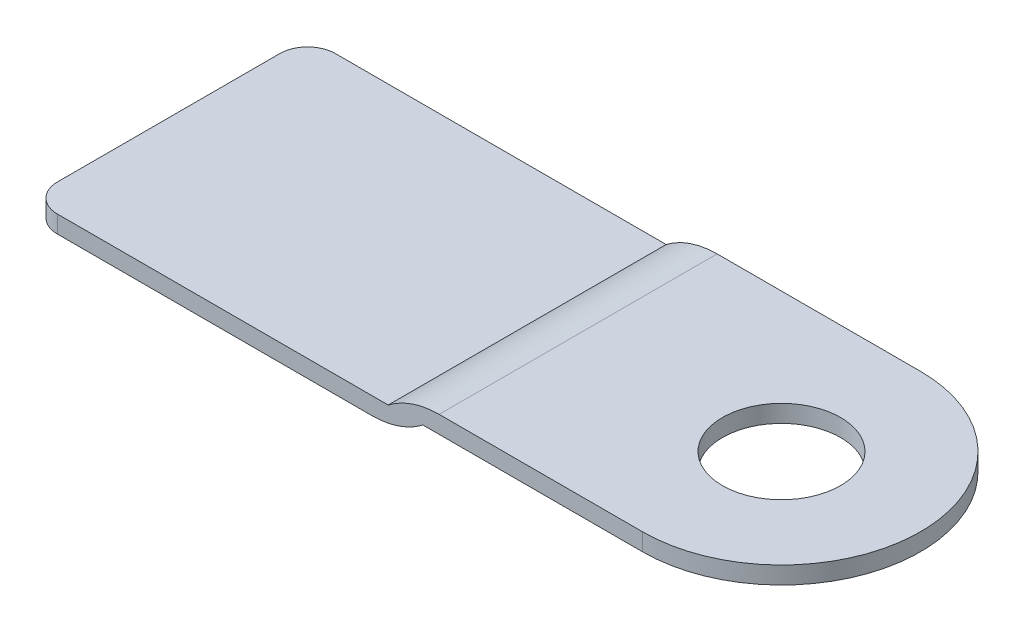
ISO-10303-21;
HEADER;
FILE_DESCRIPTION(('STEP AP214'),'2;1');
FILE_NAME('part.step','',(''),(''),'','','');
FILE_SCHEMA(('AUTOMOTIVE_DESIGN { 1 0 10303 214 1 1 1 1 }'));
ENDSEC;
DATA;
#1=APPLICATION_CONTEXT('core data for automotive mechanical design processes');
#2=APPLICATION_PROTOCOL_DEFINITION('international standard','automotive_design',2000,#1);
#3=PRODUCT_CONTEXT('',#1,'mechanical');
#4=PRODUCT('Part','Part','',(#3));
#5=PRODUCT_RELATED_PRODUCT_CATEGORY('part','',(#4));
#6=PRODUCT_DEFINITION_FORMATION('','',#4);
#7=PRODUCT_DEFINITION_CONTEXT('part definition',#1,'design');
#8=PRODUCT_DEFINITION('design','',#6,#7);
#9=PRODUCT_DEFINITION_SHAPE('','',#8);
#10=(LENGTH_UNIT() NAMED_UNIT(*) SI_UNIT(.MILLI.,.METRE.));
#11=(NAMED_UNIT(*) PLANE_ANGLE_UNIT() SI_UNIT($,.RADIAN.));
#12=(NAMED_UNIT(*) SI_UNIT($,.STERADIAN.) SOLID_ANGLE_UNIT());
#13=UNCERTAINTY_MEASURE_WITH_UNIT(LENGTH_MEASURE(1.E-05),#10,'distance_accuracy_value','');
#14=(GEOMETRIC_REPRESENTATION_CONTEXT(3) GLOBAL_UNCERTAINTY_ASSIGNED_CONTEXT((#13)) GLOBAL_UNIT_ASSIGNED_CONTEXT((#10,
#11,#12)) REPRESENTATION_CONTEXT('',''));
#15=CARTESIAN_POINT('',(0.,0.,0.));
#16=DIRECTION('',(0.,0.,1.));
#17=DIRECTION('',(1.,0.,0.));
#18=AXIS2_PLACEMENT_3D('',#15,#16,#17);
#19=CARTESIAN_POINT('',(17.05,0.,0.));
#20=DIRECTION('',(0.,1.,0.));
#21=DIRECTION('',(-1.,0.,0.));
#22=AXIS2_PLACEMENT_3D('',#19,#20,#21);
#23=CYLINDRICAL_SURFACE('',#22,10.);
#24=DIRECTION('',(0.,-1.,0.));
#25=VECTOR('',#24,1.);
#26=CARTESIAN_POINT('',(17.05,0.,10.));
#27=LINE('',#26,#25);
#28=CARTESIAN_POINT('',(17.05,0.,10.));
#29=VERTEX_POINT('',#28);
#30=CARTESIAN_POINT('',(17.05,1.25,10.));
#31=VERTEX_POINT('',#30);
#32=EDGE_CURVE('E168',#29,#31,#27,.F.);
#33=ORIENTED_EDGE('',*,*,#32,.F.);
#34=CARTESIAN_POINT('',(17.05,0.,0.));
#35=DIRECTION('',(0.,1.,0.));
#36=DIRECTION('',(-1.,0.,0.));
#37=AXIS2_PLACEMENT_3D('',#34,#35,#36);
#38=CIRCLE('',#37,10.);
#39=CARTESIAN_POINT('',(17.05,0.,-10.));
#40=VERTEX_POINT('',#39);
#41=EDGE_CURVE('E135',#40,#29,#38,.F.);
#42=ORIENTED_EDGE('',*,*,#41,.F.);
#43=DIRECTION('',(0.,1.,0.));
#44=VECTOR('',#43,1.);
#45=CARTESIAN_POINT('',(17.05,0.,-10.));
#46=LINE('',#45,#44);
#47=CARTESIAN_POINT('',(17.05,1.25,-10.));
#48=VERTEX_POINT('',#47);
#49=EDGE_CURVE('E170',#48,#40,#46,.F.);
#50=ORIENTED_EDGE('',*,*,#49,.F.);
#51=CARTESIAN_POINT('',(17.05,1.25,0.));
#52=DIRECTION('',(0.,-1.,0.));
#53=DIRECTION('',(0.,0.,-1.));
#54=AXIS2_PLACEMENT_3D('',#51,#52,#53);
#55=CIRCLE('',#54,10.);
#56=EDGE_CURVE('E174',#31,#48,#55,.F.);
#57=ORIENTED_EDGE('',*,*,#56,.F.);
#58=EDGE_LOOP('',(#33,#42,#50,#57));
#59=FACE_BOUND('',#58,.T.);
#60=ADVANCED_FACE('F41',(#59),#23,.T.);
#61=CARTESIAN_POINT('',(-27.05,0.,10.));
#62=DIRECTION('',(1.,0.,0.));
#63=DIRECTION('',(0.,0.,-1.));
#64=AXIS2_PLACEMENT_3D('',#61,#62,#63);
#65=PLANE('',#64);
#66=DIRECTION('',(0.,0.,-1.));
#67=VECTOR('',#66,1.);
#68=CARTESIAN_POINT('',(-27.05,0.,10.));
#69=LINE('',#68,#67);
#70=CARTESIAN_POINT('',(-27.05,0.,8.));
#71=VERTEX_POINT('',#70);
#72=CARTESIAN_POINT('',(-27.05,0.,-8.));
#73=VERTEX_POINT('',#72);
#74=EDGE_CURVE('E148',#71,#73,#69,.T.);
#75=ORIENTED_EDGE('',*,*,#74,.T.);
#76=DIRECTION('',(0.,-1.,0.));
#77=VECTOR('',#76,1.);
#78=CARTESIAN_POINT('',(-27.05,0.,-8.));
#79=LINE('',#78,#77);
#80=CARTESIAN_POINT('',(-27.05,-1.25,-8.));
#81=VERTEX_POINT('',#80);
#82=EDGE_CURVE('E153',#73,#81,#79,.T.);
#83=ORIENTED_EDGE('',*,*,#82,.T.);
#84=DIRECTION('',(0.,0.,-1.));
#85=VECTOR('',#84,1.);
#86=CARTESIAN_POINT('',(-27.05,-1.25,10.));
#87=LINE('',#86,#85);
#88=CARTESIAN_POINT('',(-27.05,-1.25,8.));
#89=VERTEX_POINT('',#88);
#90=EDGE_CURVE('E141',#89,#81,#87,.T.);
#91=ORIENTED_EDGE('',*,*,#90,.F.);
#92=DIRECTION('',(0.,-1.,0.));
#93=VECTOR('',#92,1.);
#94=CARTESIAN_POINT('',(-27.05,0.,8.));
#95=LINE('',#94,#93);
#96=EDGE_CURVE('E145',#89,#71,#95,.F.);
#97=ORIENTED_EDGE('',*,*,#96,.T.);
#98=EDGE_LOOP('',(#75,#83,#91,#97));
#99=FACE_BOUND('',#98,.T.);
#100=ADVANCED_FACE('F210',(#99),#65,.F.);
#101=CARTESIAN_POINT('',(-27.05,-1.25,10.));
#102=DIRECTION('',(0.,1.,0.));
#103=DIRECTION('',(0.,0.,1.));
#104=AXIS2_PLACEMENT_3D('',#101,#102,#103);
#105=PLANE('',#104);
#106=DIRECTION('',(1.,0.,0.));
#107=VECTOR('',#106,1.);
#108=CARTESIAN_POINT('',(-27.05,-1.25,-10.));
#109=LINE('',#108,#107);
#110=CARTESIAN_POINT('',(-25.05,-1.25,-10.));
#111=VERTEX_POINT('',#110);
#112=CARTESIAN_POINT('',(-2.4157195746538,-1.25,-10.));
#113=VERTEX_POINT('',#112);
#114=EDGE_CURVE('E204',#111,#113,#109,.T.);
#115=ORIENTED_EDGE('',*,*,#114,.T.);
#116=DIRECTION('',(0.,0.,-1.));
#117=VECTOR('',#116,1.);
#118=CARTESIAN_POINT('',(-2.4157195746538,-1.25,10.));
#119=LINE('',#118,#117);
#120=CARTESIAN_POINT('',(-2.4157195746538,-1.25,10.));
#121=VERTEX_POINT('',#120);
#122=EDGE_CURVE('E62',#113,#121,#119,.F.);
#123=ORIENTED_EDGE('',*,*,#122,.T.);
#124=DIRECTION('',(1.,0.,0.));
#125=VECTOR('',#124,1.);
#126=CARTESIAN_POINT('',(-27.05,-1.25,10.));
#127=LINE('',#126,#125);
#128=CARTESIAN_POINT('',(-25.05,-1.25,10.));
#129=VERTEX_POINT('',#128);
#130=EDGE_CURVE('E125',#129,#121,#127,.T.);
#131=ORIENTED_EDGE('',*,*,#130,.F.);
#132=CARTESIAN_POINT('',(-25.05,-1.25,8.));
#133=DIRECTION('',(0.,1.,0.));
#134=DIRECTION('',(0.,0.,1.));
#135=AXIS2_PLACEMENT_3D('',#132,#133,#134);
#136=CIRCLE('',#135,2.);
#137=EDGE_CURVE('E156',#129,#89,#136,.F.);
#138=ORIENTED_EDGE('',*,*,#137,.T.);
#139=ORIENTED_EDGE('',*,*,#90,.T.);
#140=CARTESIAN_POINT('',(-25.05,-1.25,-8.));
#141=DIRECTION('',(0.,1.,0.));
#142=DIRECTION('',(0.,0.,1.));
#143=AXIS2_PLACEMENT_3D('',#140,#141,#142);
#144=CIRCLE('',#143,2.);
#145=EDGE_CURVE('E158',#81,#111,#144,.F.);
#146=ORIENTED_EDGE('',*,*,#145,.T.);
#147=EDGE_LOOP('',(#115,#123,#131,#138,#139,#146));
#148=FACE_BOUND('',#147,.T.);
#149=ADVANCED_FACE('F218',(#148),#105,.F.);
#150=CARTESIAN_POINT('',(1.25,0.,10.));
#151=DIRECTION('',(0.,1.,0.));
#152=DIRECTION('',(-1.,0.,0.));
#153=AXIS2_PLACEMENT_3D('',#150,#151,#152);
#154=PLANE('',#153);
#155=CARTESIAN_POINT('',(17.05,0.,0.));
#156=DIRECTION('',(0.,1.,0.));
#157=DIRECTION('',(-1.,0.,0.));
#158=AXIS2_PLACEMENT_3D('',#155,#156,#157);
#159=CIRCLE('',#158,4.25);
#160=CARTESIAN_POINT('',(12.8,0.,0.));
#161=VERTEX_POINT('',#160);
#162=EDGE_CURVE('E219',#161,#161,#159,.T.);
#163=ORIENTED_EDGE('',*,*,#162,.T.);
#164=EDGE_LOOP('',(#163));
#165=FACE_BOUND('',#164,.T.);
#166=DIRECTION('',(1.,0.,0.));
#167=VECTOR('',#166,1.);
#168=CARTESIAN_POINT('',(1.25,0.,-10.));
#169=LINE('',#168,#167);
#170=CARTESIAN_POINT('',(1.25,0.,-10.));
#171=VERTEX_POINT('',#170);
#172=EDGE_CURVE('E201',#171,#40,#169,.T.);
#173=ORIENTED_EDGE('',*,*,#172,.T.);
#174=ORIENTED_EDGE('',*,*,#41,.T.);
#175=DIRECTION('',(1.,0.,0.));
#176=VECTOR('',#175,1.);
#177=CARTESIAN_POINT('',(1.25,0.,10.));
#178=LINE('',#177,#176);
#179=CARTESIAN_POINT('',(1.25,0.,10.));
#180=VERTEX_POINT('',#179);
#181=EDGE_CURVE('E123',#180,#29,#178,.T.);
#182=ORIENTED_EDGE('',*,*,#181,.F.);
#183=DIRECTION('',(0.,0.,-1.));
#184=VECTOR('',#183,1.);
#185=CARTESIAN_POINT('',(1.25,0.,10.));
#186=LINE('',#185,#184);
#187=EDGE_CURVE('E133',#180,#171,#186,.T.);
#188=ORIENTED_EDGE('',*,*,#187,.T.);
#189=EDGE_LOOP('',(#173,#174,#182,#188));
#190=FACE_BOUND('',#189,.T.);
#191=ADVANCED_FACE('F132',(#165,#190),#154,.F.);
#192=CARTESIAN_POINT('',(0.,1.25,10.));
#193=DIRECTION('',(0.,-1.,0.));
#194=DIRECTION('',(0.,0.,-1.));
#195=AXIS2_PLACEMENT_3D('',#192,#193,#194);
#196=PLANE('',#195);
#197=CARTESIAN_POINT('',(17.05,1.25,0.));
#198=DIRECTION('',(0.,1.,0.));
#199=DIRECTION('',(0.,0.,1.));
#200=AXIS2_PLACEMENT_3D('',#197,#198,#199);
#201=CIRCLE('',#200,4.25);
#202=CARTESIAN_POINT('',(17.05,1.25,4.25));
#203=VERTEX_POINT('',#202);
#204=EDGE_CURVE('E221',#203,#203,#201,.T.);
#205=ORIENTED_EDGE('',*,*,#204,.F.);
#206=EDGE_LOOP('',(#205));
#207=FACE_BOUND('',#206,.T.);
#208=DIRECTION('',(-1.,0.,0.));
#209=VECTOR('',#208,1.);
#210=CARTESIAN_POINT('',(0.,1.25,-10.));
#211=LINE('',#210,#209);
#212=CARTESIAN_POINT('',(2.41571957465381,1.25,-10.));
#213=VERTEX_POINT('',#212);
#214=EDGE_CURVE('E197',#48,#213,#211,.T.);
#215=ORIENTED_EDGE('',*,*,#214,.T.);
#216=DIRECTION('',(0.,0.,-1.));
#217=VECTOR('',#216,1.);
#218=CARTESIAN_POINT('',(2.41571957465381,1.25,10.));
#219=LINE('',#218,#217);
#220=CARTESIAN_POINT('',(2.41571957465381,1.25,10.));
#221=VERTEX_POINT('',#220);
#222=EDGE_CURVE('E11',#213,#221,#219,.F.);
#223=ORIENTED_EDGE('',*,*,#222,.T.);
#224=DIRECTION('',(-1.,0.,0.));
#225=VECTOR('',#224,1.);
#226=CARTESIAN_POINT('',(0.,1.25,10.));
#227=LINE('',#226,#225);
#228=EDGE_CURVE('E137',#31,#221,#227,.T.);
#229=ORIENTED_EDGE('',*,*,#228,.F.);
#230=ORIENTED_EDGE('',*,*,#56,.T.);
#231=EDGE_LOOP('',(#215,#223,#229,#230));
#232=FACE_BOUND('',#231,.T.);
#233=ADVANCED_FACE('F199',(#207,#232),#196,.F.);
#234=CARTESIAN_POINT('',(-27.05,0.,10.));
#235=DIRECTION('',(0.,-1.,0.));
#236=DIRECTION('',(1.,0.,0.));
#237=AXIS2_PLACEMENT_3D('',#234,#235,#236);
#238=PLANE('',#237);
#239=DIRECTION('',(-1.,0.,0.));
#240=VECTOR('',#239,1.);
#241=CARTESIAN_POINT('',(-27.05,0.,-10.));
#242=LINE('',#241,#240);
#243=CARTESIAN_POINT('',(-1.24999999999999,0.,-10.));
#244=VERTEX_POINT('',#243);
#245=CARTESIAN_POINT('',(-25.05,0.,-10.));
#246=VERTEX_POINT('',#245);
#247=EDGE_CURVE('E198',#244,#246,#242,.T.);
#248=ORIENTED_EDGE('',*,*,#247,.T.);
#249=CARTESIAN_POINT('',(-25.05,0.,-8.));
#250=DIRECTION('',(0.,-1.,0.));
#251=DIRECTION('',(1.,0.,0.));
#252=AXIS2_PLACEMENT_3D('',#249,#250,#251);
#253=CIRCLE('',#252,2.);
#254=EDGE_CURVE('E164',#246,#73,#253,.F.);
#255=ORIENTED_EDGE('',*,*,#254,.T.);
#256=ORIENTED_EDGE('',*,*,#74,.F.);
#257=CARTESIAN_POINT('',(-25.05,0.,8.));
#258=DIRECTION('',(0.,-1.,0.));
#259=DIRECTION('',(1.,0.,0.));
#260=AXIS2_PLACEMENT_3D('',#257,#258,#259);
#261=CIRCLE('',#260,2.);
#262=CARTESIAN_POINT('',(-25.05,0.,10.));
#263=VERTEX_POINT('',#262);
#264=EDGE_CURVE('E162',#71,#263,#261,.F.);
#265=ORIENTED_EDGE('',*,*,#264,.T.);
#266=DIRECTION('',(-1.,0.,0.));
#267=VECTOR('',#266,1.);
#268=CARTESIAN_POINT('',(-27.05,0.,10.));
#269=LINE('',#268,#267);
#270=CARTESIAN_POINT('',(-1.24999999999999,0.,10.));
#271=VERTEX_POINT('',#270);
#272=EDGE_CURVE('E183',#271,#263,#269,.T.);
#273=ORIENTED_EDGE('',*,*,#272,.F.);
#274=DIRECTION('',(0.,0.,-1.));
#275=VECTOR('',#274,1.);
#276=CARTESIAN_POINT('',(-1.24999999999999,0.,10.));
#277=LINE('',#276,#275);
#278=EDGE_CURVE('E142',#271,#244,#277,.T.);
#279=ORIENTED_EDGE('',*,*,#278,.T.);
#280=EDGE_LOOP('',(#248,#255,#256,#265,#273,#279));
#281=FACE_BOUND('',#280,.T.);
#282=ADVANCED_FACE('F189',(#281),#238,.F.);
#283=CARTESIAN_POINT('',(0.,0.,10.));
#284=DIRECTION('',(0.,0.,1.));
#285=DIRECTION('',(1.,0.,0.));
#286=AXIS2_PLACEMENT_3D('',#283,#284,#285);
#287=PLANE('',#286);
#288=ORIENTED_EDGE('',*,*,#130,.T.);
#289=CARTESIAN_POINT('',(-2.4157195746538,4.75,10.));
#290=DIRECTION('',(0.,0.,1.));
#291=DIRECTION('',(1.,0.,0.));
#292=AXIS2_PLACEMENT_3D('',#289,#290,#291);
#293=CIRCLE('',#292,6.);
#294=EDGE_CURVE('E49',#121,#180,#293,.T.);
#295=ORIENTED_EDGE('',*,*,#294,.T.);
#296=ORIENTED_EDGE('',*,*,#181,.T.);
#297=ORIENTED_EDGE('',*,*,#32,.T.);
#298=ORIENTED_EDGE('',*,*,#228,.T.);
#299=CARTESIAN_POINT('',(2.41571957465381,-4.75,10.));
#300=DIRECTION('',(0.,0.,1.));
#301=DIRECTION('',(1.,0.,0.));
#302=AXIS2_PLACEMENT_3D('',#299,#300,#301);
#303=CIRCLE('',#302,6.);
#304=EDGE_CURVE('E128',#221,#271,#303,.T.);
#305=ORIENTED_EDGE('',*,*,#304,.T.);
#306=ORIENTED_EDGE('',*,*,#272,.T.);
#307=DIRECTION('',(0.,-1.,0.));
#308=VECTOR('',#307,1.);
#309=CARTESIAN_POINT('',(-25.05,-1.25,10.));
#310=LINE('',#309,#308);
#311=EDGE_CURVE('E166',#263,#129,#310,.T.);
#312=ORIENTED_EDGE('',*,*,#311,.T.);
#313=EDGE_LOOP('',(#288,#295,#296,#297,#298,#305,#306,#312));
#314=FACE_BOUND('',#313,.T.);
#315=ADVANCED_FACE('F121',(#314),#287,.T.);
#316=CARTESIAN_POINT('',(0.,0.,-10.));
#317=DIRECTION('',(0.,0.,1.));
#318=DIRECTION('',(1.,0.,0.));
#319=AXIS2_PLACEMENT_3D('',#316,#317,#318);
#320=PLANE('',#319);
#321=ORIENTED_EDGE('',*,*,#172,.F.);
#322=CARTESIAN_POINT('',(-2.4157195746538,4.75,-10.));
#323=DIRECTION('',(0.,0.,1.));
#324=DIRECTION('',(1.,0.,0.));
#325=AXIS2_PLACEMENT_3D('',#322,#323,#324);
#326=CIRCLE('',#325,6.);
#327=EDGE_CURVE('E140',#171,#113,#326,.F.);
#328=ORIENTED_EDGE('',*,*,#327,.T.);
#329=ORIENTED_EDGE('',*,*,#114,.F.);
#330=DIRECTION('',(0.,-1.,0.));
#331=VECTOR('',#330,1.);
#332=CARTESIAN_POINT('',(-25.05,0.,-10.));
#333=LINE('',#332,#331);
#334=EDGE_CURVE('E160',#111,#246,#333,.F.);
#335=ORIENTED_EDGE('',*,*,#334,.T.);
#336=ORIENTED_EDGE('',*,*,#247,.F.);
#337=CARTESIAN_POINT('',(2.41571957465381,-4.75,-10.));
#338=DIRECTION('',(0.,0.,1.));
#339=DIRECTION('',(1.,0.,0.));
#340=AXIS2_PLACEMENT_3D('',#337,#338,#339);
#341=CIRCLE('',#340,6.);
#342=EDGE_CURVE('E176',#244,#213,#341,.F.);
#343=ORIENTED_EDGE('',*,*,#342,.T.);
#344=ORIENTED_EDGE('',*,*,#214,.F.);
#345=ORIENTED_EDGE('',*,*,#49,.T.);
#346=EDGE_LOOP('',(#321,#328,#329,#335,#336,#343,#344,#345));
#347=FACE_BOUND('',#346,.T.);
#348=ADVANCED_FACE('F196',(#347),#320,.F.);
#349=CARTESIAN_POINT('',(-25.05,0.,-8.));
#350=DIRECTION('',(0.,-1.,0.));
#351=DIRECTION('',(0.,0.,-1.));
#352=AXIS2_PLACEMENT_3D('',#349,#350,#351);
#353=CYLINDRICAL_SURFACE('',#352,2.);
#354=ORIENTED_EDGE('',*,*,#254,.F.);
#355=ORIENTED_EDGE('',*,*,#334,.F.);
#356=ORIENTED_EDGE('',*,*,#145,.F.);
#357=ORIENTED_EDGE('',*,*,#82,.F.);
#358=EDGE_LOOP('',(#354,#355,#356,#357));
#359=FACE_BOUND('',#358,.T.);
#360=ADVANCED_FACE('F215',(#359),#353,.T.);
#361=CARTESIAN_POINT('',(-25.05,0.,8.));
#362=DIRECTION('',(0.,1.,0.));
#363=DIRECTION('',(0.,0.,1.));
#364=AXIS2_PLACEMENT_3D('',#361,#362,#363);
#365=CYLINDRICAL_SURFACE('',#364,2.);
#366=ORIENTED_EDGE('',*,*,#264,.F.);
#367=ORIENTED_EDGE('',*,*,#96,.F.);
#368=ORIENTED_EDGE('',*,*,#137,.F.);
#369=ORIENTED_EDGE('',*,*,#311,.F.);
#370=EDGE_LOOP('',(#366,#367,#368,#369));
#371=FACE_BOUND('',#370,.T.);
#372=ADVANCED_FACE('F255',(#371),#365,.T.);
#373=CARTESIAN_POINT('',(-2.4157195746538,4.75,10.));
#374=DIRECTION('',(0.,0.,-1.));
#375=DIRECTION('',(-1.,0.,0.));
#376=AXIS2_PLACEMENT_3D('',#373,#374,#375);
#377=CYLINDRICAL_SURFACE('',#376,6.);
#378=ORIENTED_EDGE('',*,*,#294,.F.);
#379=ORIENTED_EDGE('',*,*,#122,.F.);
#380=ORIENTED_EDGE('',*,*,#327,.F.);
#381=ORIENTED_EDGE('',*,*,#187,.F.);
#382=EDGE_LOOP('',(#378,#379,#380,#381));
#383=FACE_BOUND('',#382,.T.);
#384=ADVANCED_FACE('F139',(#383),#377,.T.);
#385=CARTESIAN_POINT('',(2.41571957465381,-4.75,10.));
#386=DIRECTION('',(0.,0.,-1.));
#387=DIRECTION('',(-1.,0.,0.));
#388=AXIS2_PLACEMENT_3D('',#385,#386,#387);
#389=CYLINDRICAL_SURFACE('',#388,6.);
#390=ORIENTED_EDGE('',*,*,#304,.F.);
#391=ORIENTED_EDGE('',*,*,#222,.F.);
#392=ORIENTED_EDGE('',*,*,#342,.F.);
#393=ORIENTED_EDGE('',*,*,#278,.F.);
#394=EDGE_LOOP('',(#390,#391,#392,#393));
#395=FACE_BOUND('',#394,.T.);
#396=ADVANCED_FACE('F43',(#395),#389,.T.);
#397=CARTESIAN_POINT('',(17.05,-1.25,0.));
#398=DIRECTION('',(0.,1.,0.));
#399=DIRECTION('',(0.,0.,1.));
#400=AXIS2_PLACEMENT_3D('',#397,#398,#399);
#401=CYLINDRICAL_SURFACE('',#400,4.25);
#402=ORIENTED_EDGE('',*,*,#204,.T.);
#403=EDGE_LOOP('',(#402));
#404=FACE_BOUND('',#403,.T.);
#405=ORIENTED_EDGE('',*,*,#162,.F.);
#406=EDGE_LOOP('',(#405));
#407=FACE_BOUND('',#406,.T.);
#408=ADVANCED_FACE('F229',(#404,#407),#401,.F.);
#409=CLOSED_SHELL('',(#60,#100,#149,#191,#233,#282,#315,#348,#360,#372,#384,#396,#408));
#410=MANIFOLD_SOLID_BREP('B2',#409);
#411=ADVANCED_BREP_SHAPE_REPRESENTATION('',(#18,#410),#14);
#412=SHAPE_DEFINITION_REPRESENTATION(#9,#411);
ENDSEC;
END-ISO-10303-21;
